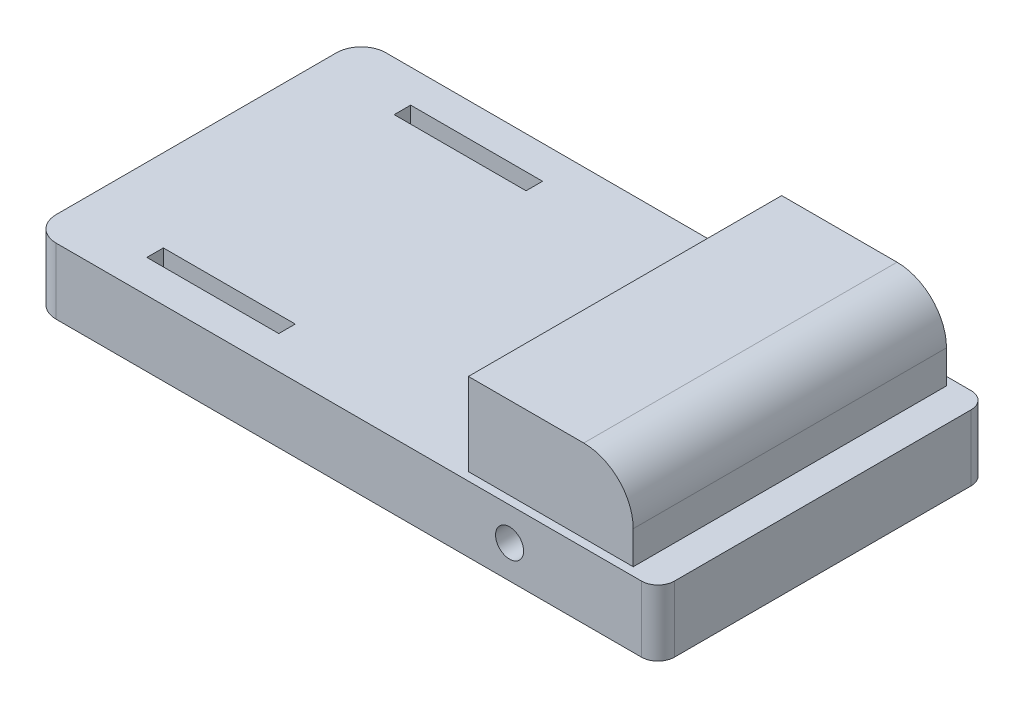
ISO-10303-21;
HEADER;
FILE_DESCRIPTION(('STEP AP214'),'2;1');
FILE_NAME('part.step','',(''),(''),'','','');
FILE_SCHEMA(('AUTOMOTIVE_DESIGN { 1 0 10303 214 1 1 1 1 }'));
ENDSEC;
DATA;
#1=APPLICATION_CONTEXT('core data for automotive mechanical design processes');
#2=APPLICATION_PROTOCOL_DEFINITION('international standard','automotive_design',2000,#1);
#3=PRODUCT_CONTEXT('',#1,'mechanical');
#4=PRODUCT('Part','Part','',(#3));
#5=PRODUCT_RELATED_PRODUCT_CATEGORY('part','',(#4));
#6=PRODUCT_DEFINITION_FORMATION('','',#4);
#7=PRODUCT_DEFINITION_CONTEXT('part definition',#1,'design');
#8=PRODUCT_DEFINITION('design','',#6,#7);
#9=PRODUCT_DEFINITION_SHAPE('','',#8);
#10=(LENGTH_UNIT() NAMED_UNIT(*) SI_UNIT(.MILLI.,.METRE.));
#11=(NAMED_UNIT(*) PLANE_ANGLE_UNIT() SI_UNIT($,.RADIAN.));
#12=(NAMED_UNIT(*) SI_UNIT($,.STERADIAN.) SOLID_ANGLE_UNIT());
#13=UNCERTAINTY_MEASURE_WITH_UNIT(LENGTH_MEASURE(1.E-05),#10,'distance_accuracy_value','');
#14=(GEOMETRIC_REPRESENTATION_CONTEXT(3) GLOBAL_UNCERTAINTY_ASSIGNED_CONTEXT((#13)) GLOBAL_UNIT_ASSIGNED_CONTEXT((#10,
#11,#12)) REPRESENTATION_CONTEXT('',''));
#15=CARTESIAN_POINT('',(0.,0.,0.));
#16=DIRECTION('',(0.,0.,1.));
#17=DIRECTION('',(1.,0.,0.));
#18=AXIS2_PLACEMENT_3D('',#15,#16,#17);
#19=CARTESIAN_POINT('',(0.,101.6,0.));
#20=DIRECTION('',(0.,1.,0.));
#21=DIRECTION('',(0.,0.,1.));
#22=AXIS2_PLACEMENT_3D('',#19,#20,#21);
#23=PLANE('',#22);
#24=DIRECTION('',(0.,0.,1.));
#25=VECTOR('',#24,1.);
#26=CARTESIAN_POINT('',(-355.6,101.6,177.8));
#27=LINE('',#26,#25);
#28=CARTESIAN_POINT('',(-355.6,101.6,177.8));
#29=VERTEX_POINT('',#28);
#30=CARTESIAN_POINT('',(-355.6,101.6,203.2));
#31=VERTEX_POINT('',#30);
#32=EDGE_CURVE('E277',#29,#31,#27,.T.);
#33=ORIENTED_EDGE('',*,*,#32,.F.);
#34=DIRECTION('',(-1.,0.,0.));
#35=VECTOR('',#34,1.);
#36=CARTESIAN_POINT('',(-355.6,101.6,177.8));
#37=LINE('',#36,#35);
#38=CARTESIAN_POINT('',(-152.4,101.6,177.8));
#39=VERTEX_POINT('',#38);
#40=EDGE_CURVE('E285',#39,#29,#37,.T.);
#41=ORIENTED_EDGE('',*,*,#40,.F.);
#42=DIRECTION('',(0.,0.,-1.));
#43=VECTOR('',#42,1.);
#44=CARTESIAN_POINT('',(-152.4,101.6,177.8));
#45=LINE('',#44,#43);
#46=CARTESIAN_POINT('',(-152.4,101.6,203.2));
#47=VERTEX_POINT('',#46);
#48=EDGE_CURVE('E282',#47,#39,#45,.T.);
#49=ORIENTED_EDGE('',*,*,#48,.F.);
#50=DIRECTION('',(1.,0.,0.));
#51=VECTOR('',#50,1.);
#52=CARTESIAN_POINT('',(-355.6,101.6,203.2));
#53=LINE('',#52,#51);
#54=EDGE_CURVE('E279',#31,#47,#53,.T.);
#55=ORIENTED_EDGE('',*,*,#54,.F.);
#56=EDGE_LOOP('',(#33,#41,#49,#55));
#57=FACE_BOUND('',#56,.T.);
#58=DIRECTION('',(1.,0.,0.));
#59=VECTOR('',#58,1.);
#60=CARTESIAN_POINT('',(-355.6,101.6,-177.8));
#61=LINE('',#60,#59);
#62=CARTESIAN_POINT('',(-355.6,101.6,-177.8));
#63=VERTEX_POINT('',#62);
#64=CARTESIAN_POINT('',(-152.4,101.6,-177.8));
#65=VERTEX_POINT('',#64);
#66=EDGE_CURVE('E308',#63,#65,#61,.T.);
#67=ORIENTED_EDGE('',*,*,#66,.F.);
#68=DIRECTION('',(0.,0.,1.));
#69=VECTOR('',#68,1.);
#70=CARTESIAN_POINT('',(-355.6,101.6,-177.8));
#71=LINE('',#70,#69);
#72=CARTESIAN_POINT('',(-355.6,101.6,-203.2));
#73=VERTEX_POINT('',#72);
#74=EDGE_CURVE('E316',#73,#63,#71,.T.);
#75=ORIENTED_EDGE('',*,*,#74,.F.);
#76=DIRECTION('',(-1.,0.,0.));
#77=VECTOR('',#76,1.);
#78=CARTESIAN_POINT('',(-355.6,101.6,-203.2));
#79=LINE('',#78,#77);
#80=CARTESIAN_POINT('',(-152.4,101.6,-203.2));
#81=VERTEX_POINT('',#80);
#82=EDGE_CURVE('E313',#81,#73,#79,.T.);
#83=ORIENTED_EDGE('',*,*,#82,.F.);
#84=DIRECTION('',(0.,0.,-1.));
#85=VECTOR('',#84,1.);
#86=CARTESIAN_POINT('',(-152.4,101.6,-177.8));
#87=LINE('',#86,#85);
#88=EDGE_CURVE('E310',#65,#81,#87,.T.);
#89=ORIENTED_EDGE('',*,*,#88,.F.);
#90=EDGE_LOOP('',(#67,#75,#83,#89));
#91=FACE_BOUND('',#90,.T.);
#92=DIRECTION('',(1.,0.,0.));
#93=VECTOR('',#92,1.);
#94=CARTESIAN_POINT('',(-482.6,101.6,254.));
#95=LINE('',#94,#93);
#96=CARTESIAN_POINT('',(-444.5,101.6,254.));
#97=VERTEX_POINT('',#96);
#98=CARTESIAN_POINT('',(457.2,101.6,254.));
#99=VERTEX_POINT('',#98);
#100=EDGE_CURVE('E339',#97,#99,#95,.T.);
#101=ORIENTED_EDGE('',*,*,#100,.T.);
#102=CARTESIAN_POINT('',(457.2,101.6,228.6));
#103=DIRECTION('',(0.,1.,0.));
#104=DIRECTION('',(0.,0.,1.));
#105=AXIS2_PLACEMENT_3D('',#102,#103,#104);
#106=CIRCLE('',#105,25.4);
#107=CARTESIAN_POINT('',(482.6,101.6,228.6));
#108=VERTEX_POINT('',#107);
#109=EDGE_CURVE('E390',#99,#108,#106,.T.);
#110=ORIENTED_EDGE('',*,*,#109,.T.);
#111=DIRECTION('',(0.,0.,-1.));
#112=VECTOR('',#111,1.);
#113=CARTESIAN_POINT('',(482.6,101.6,-254.));
#114=LINE('',#113,#112);
#115=CARTESIAN_POINT('',(482.6,101.6,-228.6));
#116=VERTEX_POINT('',#115);
#117=EDGE_CURVE('E343',#108,#116,#114,.T.);
#118=ORIENTED_EDGE('',*,*,#117,.T.);
#119=CARTESIAN_POINT('',(457.2,101.6,-228.6));
#120=DIRECTION('',(0.,1.,0.));
#121=DIRECTION('',(0.,0.,1.));
#122=AXIS2_PLACEMENT_3D('',#119,#120,#121);
#123=CIRCLE('',#122,25.4);
#124=CARTESIAN_POINT('',(457.2,101.6,-254.));
#125=VERTEX_POINT('',#124);
#126=EDGE_CURVE('E388',#116,#125,#123,.T.);
#127=ORIENTED_EDGE('',*,*,#126,.T.);
#128=DIRECTION('',(-1.,0.,0.));
#129=VECTOR('',#128,1.);
#130=CARTESIAN_POINT('',(-482.6,101.6,-254.));
#131=LINE('',#130,#129);
#132=CARTESIAN_POINT('',(-444.5,101.6,-254.));
#133=VERTEX_POINT('',#132);
#134=EDGE_CURVE('E346',#125,#133,#131,.T.);
#135=ORIENTED_EDGE('',*,*,#134,.T.);
#136=CARTESIAN_POINT('',(-444.5,101.6,-215.9));
#137=DIRECTION('',(0.,1.,0.));
#138=DIRECTION('',(0.,0.,1.));
#139=AXIS2_PLACEMENT_3D('',#136,#137,#138);
#140=CIRCLE('',#139,38.1);
#141=CARTESIAN_POINT('',(-482.6,101.6,-215.9));
#142=VERTEX_POINT('',#141);
#143=EDGE_CURVE('E372',#133,#142,#140,.T.);
#144=ORIENTED_EDGE('',*,*,#143,.T.);
#145=DIRECTION('',(0.,0.,1.));
#146=VECTOR('',#145,1.);
#147=CARTESIAN_POINT('',(-482.6,101.6,-254.));
#148=LINE('',#147,#146);
#149=CARTESIAN_POINT('',(-482.6,101.6,215.9));
#150=VERTEX_POINT('',#149);
#151=EDGE_CURVE('E336',#142,#150,#148,.T.);
#152=ORIENTED_EDGE('',*,*,#151,.T.);
#153=CARTESIAN_POINT('',(-444.5,101.6,215.9));
#154=DIRECTION('',(0.,1.,0.));
#155=DIRECTION('',(0.,0.,1.));
#156=AXIS2_PLACEMENT_3D('',#153,#154,#155);
#157=CIRCLE('',#156,38.1);
#158=EDGE_CURVE('E370',#150,#97,#157,.T.);
#159=ORIENTED_EDGE('',*,*,#158,.T.);
#160=EDGE_LOOP('',(#101,#110,#118,#127,#135,#144,#152,#159));
#161=FACE_BOUND('',#160,.T.);
#162=DIRECTION('',(1.,0.,0.));
#163=VECTOR('',#162,1.);
#164=CARTESIAN_POINT('',(177.882783197664,101.6,241.3));
#165=LINE('',#164,#163);
#166=CARTESIAN_POINT('',(177.882783197664,101.6,241.3));
#167=VERTEX_POINT('',#166);
#168=CARTESIAN_POINT('',(431.8,101.6,241.3));
#169=VERTEX_POINT('',#168);
#170=EDGE_CURVE('E251',#167,#169,#165,.T.);
#171=ORIENTED_EDGE('',*,*,#170,.F.);
#172=DIRECTION('',(0.,0.,1.));
#173=VECTOR('',#172,1.);
#174=CARTESIAN_POINT('',(177.882783197663,101.6,-241.3));
#175=LINE('',#174,#173);
#176=CARTESIAN_POINT('',(177.882783197664,101.6,228.6));
#177=VERTEX_POINT('',#176);
#178=EDGE_CURVE('E235',#177,#167,#175,.T.);
#179=ORIENTED_EDGE('',*,*,#178,.F.);
#180=DIRECTION('',(-1.,0.,0.));
#181=VECTOR('',#180,1.);
#182=CARTESIAN_POINT('',(356.882783197664,101.6,228.6));
#183=LINE('',#182,#181);
#184=CARTESIAN_POINT('',(356.882783197664,101.6,228.6));
#185=VERTEX_POINT('',#184);
#186=EDGE_CURVE('E208',#185,#177,#183,.T.);
#187=ORIENTED_EDGE('',*,*,#186,.F.);
#188=DIRECTION('',(0.,0.,1.));
#189=VECTOR('',#188,1.);
#190=CARTESIAN_POINT('',(356.882783197664,101.6,-228.6));
#191=LINE('',#190,#189);
#192=CARTESIAN_POINT('',(356.882783197664,101.6,-228.6));
#193=VERTEX_POINT('',#192);
#194=EDGE_CURVE('E212',#193,#185,#191,.T.);
#195=ORIENTED_EDGE('',*,*,#194,.F.);
#196=DIRECTION('',(-1.,0.,0.));
#197=VECTOR('',#196,1.);
#198=CARTESIAN_POINT('',(356.882783197664,101.6,-228.6));
#199=LINE('',#198,#197);
#200=CARTESIAN_POINT('',(177.882783197663,101.6,-228.6));
#201=VERTEX_POINT('',#200);
#202=EDGE_CURVE('E199',#193,#201,#199,.T.);
#203=ORIENTED_EDGE('',*,*,#202,.T.);
#204=CARTESIAN_POINT('',(177.882783197663,101.6,-241.3));
#205=VERTEX_POINT('',#204);
#206=EDGE_CURVE('E249',#205,#201,#175,.T.);
#207=ORIENTED_EDGE('',*,*,#206,.F.);
#208=DIRECTION('',(-1.,0.,0.));
#209=VECTOR('',#208,1.);
#210=CARTESIAN_POINT('',(177.882783197663,101.6,-241.3));
#211=LINE('',#210,#209);
#212=CARTESIAN_POINT('',(431.8,101.6,-241.3));
#213=VERTEX_POINT('',#212);
#214=EDGE_CURVE('E243',#213,#205,#211,.T.);
#215=ORIENTED_EDGE('',*,*,#214,.F.);
#216=DIRECTION('',(0.,0.,-1.));
#217=VECTOR('',#216,1.);
#218=CARTESIAN_POINT('',(431.8,101.6,-241.3));
#219=LINE('',#218,#217);
#220=EDGE_CURVE('E254',#169,#213,#219,.T.);
#221=ORIENTED_EDGE('',*,*,#220,.F.);
#222=EDGE_LOOP('',(#171,#179,#187,#195,#203,#207,#215,#221));
#223=FACE_BOUND('',#222,.T.);
#224=ADVANCED_FACE('F35',(#57,#91,#161,#223),#23,.T.);
#225=CARTESIAN_POINT('',(-482.6,101.6,-254.));
#226=DIRECTION('',(1.,0.,0.));
#227=DIRECTION('',(0.,0.,-1.));
#228=AXIS2_PLACEMENT_3D('',#225,#226,#227);
#229=PLANE('',#228);
#230=ORIENTED_EDGE('',*,*,#151,.F.);
#231=DIRECTION('',(0.,-1.,0.));
#232=VECTOR('',#231,1.);
#233=CARTESIAN_POINT('',(-482.6,101.6,-215.9));
#234=LINE('',#233,#232);
#235=CARTESIAN_POINT('',(-482.6,0.,-215.9));
#236=VERTEX_POINT('',#235);
#237=EDGE_CURVE('E359',#142,#236,#234,.T.);
#238=ORIENTED_EDGE('',*,*,#237,.T.);
#239=DIRECTION('',(0.,0.,1.));
#240=VECTOR('',#239,1.);
#241=CARTESIAN_POINT('',(-482.6,0.,-254.));
#242=LINE('',#241,#240);
#243=CARTESIAN_POINT('',(-482.6,0.,215.9));
#244=VERTEX_POINT('',#243);
#245=EDGE_CURVE('E333',#236,#244,#242,.T.);
#246=ORIENTED_EDGE('',*,*,#245,.T.);
#247=DIRECTION('',(0.,-1.,0.));
#248=VECTOR('',#247,1.);
#249=CARTESIAN_POINT('',(-482.6,101.6,215.9));
#250=LINE('',#249,#248);
#251=EDGE_CURVE('E348',#244,#150,#250,.F.);
#252=ORIENTED_EDGE('',*,*,#251,.T.);
#253=EDGE_LOOP('',(#230,#238,#246,#252));
#254=FACE_BOUND('',#253,.T.);
#255=ADVANCED_FACE('F433',(#254),#229,.F.);
#256=CARTESIAN_POINT('',(-482.6,101.6,254.));
#257=DIRECTION('',(0.,0.,-1.));
#258=DIRECTION('',(-1.,0.,0.));
#259=AXIS2_PLACEMENT_3D('',#256,#257,#258);
#260=PLANE('',#259);
#261=CARTESIAN_POINT('',(254.,50.8,254.));
#262=DIRECTION('',(0.,0.,1.));
#263=DIRECTION('',(1.,0.,0.));
#264=AXIS2_PLACEMENT_3D('',#261,#262,#263);
#265=CIRCLE('',#264,21.59);
#266=CARTESIAN_POINT('',(275.59,50.8,254.));
#267=VERTEX_POINT('',#266);
#268=EDGE_CURVE('E300',#267,#267,#265,.T.);
#269=ORIENTED_EDGE('',*,*,#268,.F.);
#270=EDGE_LOOP('',(#269));
#271=FACE_BOUND('',#270,.T.);
#272=DIRECTION('',(1.,0.,0.));
#273=VECTOR('',#272,1.);
#274=CARTESIAN_POINT('',(-482.6,0.,254.));
#275=LINE('',#274,#273);
#276=CARTESIAN_POINT('',(-444.5,0.,254.));
#277=VERTEX_POINT('',#276);
#278=CARTESIAN_POINT('',(457.2,0.,254.));
#279=VERTEX_POINT('',#278);
#280=EDGE_CURVE('E351',#277,#279,#275,.T.);
#281=ORIENTED_EDGE('',*,*,#280,.T.);
#282=DIRECTION('',(0.,-1.,0.));
#283=VECTOR('',#282,1.);
#284=CARTESIAN_POINT('',(457.2,101.6,254.));
#285=LINE('',#284,#283);
#286=EDGE_CURVE('E386',#279,#99,#285,.F.);
#287=ORIENTED_EDGE('',*,*,#286,.T.);
#288=ORIENTED_EDGE('',*,*,#100,.F.);
#289=DIRECTION('',(0.,-1.,0.));
#290=VECTOR('',#289,1.);
#291=CARTESIAN_POINT('',(-444.5,101.6,254.));
#292=LINE('',#291,#290);
#293=EDGE_CURVE('E374',#97,#277,#292,.T.);
#294=ORIENTED_EDGE('',*,*,#293,.T.);
#295=EDGE_LOOP('',(#281,#287,#288,#294));
#296=FACE_BOUND('',#295,.T.);
#297=ADVANCED_FACE('F439',(#271,#296),#260,.F.);
#298=CARTESIAN_POINT('',(482.6,101.6,-254.));
#299=DIRECTION('',(-1.,0.,0.));
#300=DIRECTION('',(0.,0.,1.));
#301=AXIS2_PLACEMENT_3D('',#298,#299,#300);
#302=PLANE('',#301);
#303=ORIENTED_EDGE('',*,*,#117,.F.);
#304=DIRECTION('',(0.,-1.,0.));
#305=VECTOR('',#304,1.);
#306=CARTESIAN_POINT('',(482.6,101.6,228.6));
#307=LINE('',#306,#305);
#308=CARTESIAN_POINT('',(482.6,0.,228.6));
#309=VERTEX_POINT('',#308);
#310=EDGE_CURVE('E379',#108,#309,#307,.T.);
#311=ORIENTED_EDGE('',*,*,#310,.T.);
#312=DIRECTION('',(0.,0.,-1.));
#313=VECTOR('',#312,1.);
#314=CARTESIAN_POINT('',(482.6,0.,-254.));
#315=LINE('',#314,#313);
#316=CARTESIAN_POINT('',(482.6,0.,-228.6));
#317=VERTEX_POINT('',#316);
#318=EDGE_CURVE('E354',#309,#317,#315,.T.);
#319=ORIENTED_EDGE('',*,*,#318,.T.);
#320=DIRECTION('',(0.,-1.,0.));
#321=VECTOR('',#320,1.);
#322=CARTESIAN_POINT('',(482.6,101.6,-228.6));
#323=LINE('',#322,#321);
#324=EDGE_CURVE('E377',#317,#116,#323,.F.);
#325=ORIENTED_EDGE('',*,*,#324,.T.);
#326=EDGE_LOOP('',(#303,#311,#319,#325));
#327=FACE_BOUND('',#326,.T.);
#328=ADVANCED_FACE('F455',(#327),#302,.F.);
#329=CARTESIAN_POINT('',(-482.6,101.6,-254.));
#330=DIRECTION('',(0.,0.,1.));
#331=DIRECTION('',(1.,0.,0.));
#332=AXIS2_PLACEMENT_3D('',#329,#330,#331);
#333=PLANE('',#332);
#334=CARTESIAN_POINT('',(254.,50.8,-254.));
#335=DIRECTION('',(0.,0.,1.));
#336=DIRECTION('',(1.,0.,0.));
#337=AXIS2_PLACEMENT_3D('',#334,#335,#336);
#338=CIRCLE('',#337,21.59);
#339=CARTESIAN_POINT('',(275.59,50.8,-254.));
#340=VERTEX_POINT('',#339);
#341=EDGE_CURVE('E330',#340,#340,#338,.T.);
#342=ORIENTED_EDGE('',*,*,#341,.T.);
#343=EDGE_LOOP('',(#342));
#344=FACE_BOUND('',#343,.T.);
#345=ORIENTED_EDGE('',*,*,#134,.F.);
#346=DIRECTION('',(0.,-1.,0.));
#347=VECTOR('',#346,1.);
#348=CARTESIAN_POINT('',(457.2,101.6,-254.));
#349=LINE('',#348,#347);
#350=CARTESIAN_POINT('',(457.2,0.,-254.));
#351=VERTEX_POINT('',#350);
#352=EDGE_CURVE('E392',#125,#351,#349,.T.);
#353=ORIENTED_EDGE('',*,*,#352,.T.);
#354=DIRECTION('',(-1.,0.,0.));
#355=VECTOR('',#354,1.);
#356=CARTESIAN_POINT('',(-482.6,0.,-254.));
#357=LINE('',#356,#355);
#358=CARTESIAN_POINT('',(-444.5,0.,-254.));
#359=VERTEX_POINT('',#358);
#360=EDGE_CURVE('E340',#351,#359,#357,.T.);
#361=ORIENTED_EDGE('',*,*,#360,.T.);
#362=DIRECTION('',(0.,-1.,0.));
#363=VECTOR('',#362,1.);
#364=CARTESIAN_POINT('',(-444.5,101.6,-254.));
#365=LINE('',#364,#363);
#366=EDGE_CURVE('E367',#359,#133,#365,.F.);
#367=ORIENTED_EDGE('',*,*,#366,.T.);
#368=EDGE_LOOP('',(#345,#353,#361,#367));
#369=FACE_BOUND('',#368,.T.);
#370=ADVANCED_FACE('F451',(#344,#369),#333,.F.);
#371=CARTESIAN_POINT('',(0.,0.,0.));
#372=DIRECTION('',(0.,1.,0.));
#373=DIRECTION('',(0.,0.,1.));
#374=AXIS2_PLACEMENT_3D('',#371,#372,#373);
#375=PLANE('',#374);
#376=DIRECTION('',(1.,0.,0.));
#377=VECTOR('',#376,1.);
#378=CARTESIAN_POINT('',(-355.6,0.,177.8));
#379=LINE('',#378,#377);
#380=CARTESIAN_POINT('',(-355.6,0.,177.8));
#381=VERTEX_POINT('',#380);
#382=CARTESIAN_POINT('',(-152.4,0.,177.8));
#383=VERTEX_POINT('',#382);
#384=EDGE_CURVE('E270',#381,#383,#379,.T.);
#385=ORIENTED_EDGE('',*,*,#384,.F.);
#386=DIRECTION('',(0.,0.,-1.));
#387=VECTOR('',#386,1.);
#388=CARTESIAN_POINT('',(-355.6,0.,177.8));
#389=LINE('',#388,#387);
#390=CARTESIAN_POINT('',(-355.6,0.,203.2));
#391=VERTEX_POINT('',#390);
#392=EDGE_CURVE('E274',#391,#381,#389,.T.);
#393=ORIENTED_EDGE('',*,*,#392,.F.);
#394=DIRECTION('',(-1.,0.,0.));
#395=VECTOR('',#394,1.);
#396=CARTESIAN_POINT('',(-355.6,0.,203.2));
#397=LINE('',#396,#395);
#398=CARTESIAN_POINT('',(-152.4,0.,203.2));
#399=VERTEX_POINT('',#398);
#400=EDGE_CURVE('E291',#399,#391,#397,.T.);
#401=ORIENTED_EDGE('',*,*,#400,.F.);
#402=DIRECTION('',(0.,0.,1.));
#403=VECTOR('',#402,1.);
#404=CARTESIAN_POINT('',(-152.4,0.,177.8));
#405=LINE('',#404,#403);
#406=EDGE_CURVE('E268',#383,#399,#405,.T.);
#407=ORIENTED_EDGE('',*,*,#406,.F.);
#408=EDGE_LOOP('',(#385,#393,#401,#407));
#409=FACE_BOUND('',#408,.T.);
#410=DIRECTION('',(0.,0.,-1.));
#411=VECTOR('',#410,1.);
#412=CARTESIAN_POINT('',(-355.6,0.,-177.8));
#413=LINE('',#412,#411);
#414=CARTESIAN_POINT('',(-355.6,0.,-177.8));
#415=VERTEX_POINT('',#414);
#416=CARTESIAN_POINT('',(-355.6,0.,-203.2));
#417=VERTEX_POINT('',#416);
#418=EDGE_CURVE('E302',#415,#417,#413,.T.);
#419=ORIENTED_EDGE('',*,*,#418,.F.);
#420=DIRECTION('',(-1.,0.,0.));
#421=VECTOR('',#420,1.);
#422=CARTESIAN_POINT('',(-355.6,0.,-177.8));
#423=LINE('',#422,#421);
#424=CARTESIAN_POINT('',(-152.4,0.,-177.8));
#425=VERTEX_POINT('',#424);
#426=EDGE_CURVE('E305',#425,#415,#423,.T.);
#427=ORIENTED_EDGE('',*,*,#426,.F.);
#428=DIRECTION('',(0.,0.,1.));
#429=VECTOR('',#428,1.);
#430=CARTESIAN_POINT('',(-152.4,0.,-177.8));
#431=LINE('',#430,#429);
#432=CARTESIAN_POINT('',(-152.4,0.,-203.2));
#433=VERTEX_POINT('',#432);
#434=EDGE_CURVE('E271',#433,#425,#431,.T.);
#435=ORIENTED_EDGE('',*,*,#434,.F.);
#436=DIRECTION('',(1.,0.,0.));
#437=VECTOR('',#436,1.);
#438=CARTESIAN_POINT('',(-355.6,0.,-203.2));
#439=LINE('',#438,#437);
#440=EDGE_CURVE('E267',#417,#433,#439,.T.);
#441=ORIENTED_EDGE('',*,*,#440,.F.);
#442=EDGE_LOOP('',(#419,#427,#435,#441));
#443=FACE_BOUND('',#442,.T.);
#444=ORIENTED_EDGE('',*,*,#318,.F.);
#445=CARTESIAN_POINT('',(457.2,0.,228.6));
#446=DIRECTION('',(0.,1.,0.));
#447=DIRECTION('',(0.,0.,1.));
#448=AXIS2_PLACEMENT_3D('',#445,#446,#447);
#449=CIRCLE('',#448,25.4);
#450=EDGE_CURVE('E384',#309,#279,#449,.F.);
#451=ORIENTED_EDGE('',*,*,#450,.T.);
#452=ORIENTED_EDGE('',*,*,#280,.F.);
#453=CARTESIAN_POINT('',(-444.5,0.,215.9));
#454=DIRECTION('',(0.,1.,0.));
#455=DIRECTION('',(0.,0.,1.));
#456=AXIS2_PLACEMENT_3D('',#453,#454,#455);
#457=CIRCLE('',#456,38.1);
#458=EDGE_CURVE('E362',#277,#244,#457,.F.);
#459=ORIENTED_EDGE('',*,*,#458,.T.);
#460=ORIENTED_EDGE('',*,*,#245,.F.);
#461=CARTESIAN_POINT('',(-444.5,0.,-215.9));
#462=DIRECTION('',(0.,1.,0.));
#463=DIRECTION('',(0.,0.,1.));
#464=AXIS2_PLACEMENT_3D('',#461,#462,#463);
#465=CIRCLE('',#464,38.1);
#466=EDGE_CURVE('E364',#236,#359,#465,.F.);
#467=ORIENTED_EDGE('',*,*,#466,.T.);
#468=ORIENTED_EDGE('',*,*,#360,.F.);
#469=CARTESIAN_POINT('',(457.2,0.,-228.6));
#470=DIRECTION('',(0.,1.,0.));
#471=DIRECTION('',(0.,0.,1.));
#472=AXIS2_PLACEMENT_3D('',#469,#470,#471);
#473=CIRCLE('',#472,25.4);
#474=EDGE_CURVE('E382',#351,#317,#473,.F.);
#475=ORIENTED_EDGE('',*,*,#474,.T.);
#476=EDGE_LOOP('',(#444,#451,#452,#459,#460,#467,#468,#475));
#477=FACE_BOUND('',#476,.T.);
#478=ADVANCED_FACE('F448',(#409,#443,#477),#375,.F.);
#479=CARTESIAN_POINT('',(254.,50.8,-254.));
#480=DIRECTION('',(0.,0.,1.));
#481=DIRECTION('',(1.,0.,0.));
#482=AXIS2_PLACEMENT_3D('',#479,#480,#481);
#483=CYLINDRICAL_SURFACE('',#482,21.59);
#484=ORIENTED_EDGE('',*,*,#341,.F.);
#485=EDGE_LOOP('',(#484));
#486=FACE_BOUND('',#485,.T.);
#487=ORIENTED_EDGE('',*,*,#268,.T.);
#488=EDGE_LOOP('',(#487));
#489=FACE_BOUND('',#488,.T.);
#490=ADVANCED_FACE('F446',(#486,#489),#483,.F.);
#491=CARTESIAN_POINT('',(-444.5,101.6,-215.9));
#492=DIRECTION('',(0.,-1.,0.));
#493=DIRECTION('',(0.,0.,-1.));
#494=AXIS2_PLACEMENT_3D('',#491,#492,#493);
#495=CYLINDRICAL_SURFACE('',#494,38.1);
#496=ORIENTED_EDGE('',*,*,#143,.F.);
#497=ORIENTED_EDGE('',*,*,#366,.F.);
#498=ORIENTED_EDGE('',*,*,#466,.F.);
#499=ORIENTED_EDGE('',*,*,#237,.F.);
#500=EDGE_LOOP('',(#496,#497,#498,#499));
#501=FACE_BOUND('',#500,.T.);
#502=ADVANCED_FACE('F463',(#501),#495,.T.);
#503=CARTESIAN_POINT('',(-444.5,101.6,215.9));
#504=DIRECTION('',(0.,-1.,0.));
#505=DIRECTION('',(0.,0.,-1.));
#506=AXIS2_PLACEMENT_3D('',#503,#504,#505);
#507=CYLINDRICAL_SURFACE('',#506,38.1);
#508=ORIENTED_EDGE('',*,*,#158,.F.);
#509=ORIENTED_EDGE('',*,*,#251,.F.);
#510=ORIENTED_EDGE('',*,*,#458,.F.);
#511=ORIENTED_EDGE('',*,*,#293,.F.);
#512=EDGE_LOOP('',(#508,#509,#510,#511));
#513=FACE_BOUND('',#512,.T.);
#514=ADVANCED_FACE('F466',(#513),#507,.T.);
#515=CARTESIAN_POINT('',(457.2,101.6,228.6));
#516=DIRECTION('',(0.,-1.,0.));
#517=DIRECTION('',(0.,0.,-1.));
#518=AXIS2_PLACEMENT_3D('',#515,#516,#517);
#519=CYLINDRICAL_SURFACE('',#518,25.4);
#520=ORIENTED_EDGE('',*,*,#109,.F.);
#521=ORIENTED_EDGE('',*,*,#286,.F.);
#522=ORIENTED_EDGE('',*,*,#450,.F.);
#523=ORIENTED_EDGE('',*,*,#310,.F.);
#524=EDGE_LOOP('',(#520,#521,#522,#523));
#525=FACE_BOUND('',#524,.T.);
#526=ADVANCED_FACE('F470',(#525),#519,.T.);
#527=CARTESIAN_POINT('',(457.2,101.6,-228.6));
#528=DIRECTION('',(0.,-1.,0.));
#529=DIRECTION('',(0.,0.,-1.));
#530=AXIS2_PLACEMENT_3D('',#527,#528,#529);
#531=CYLINDRICAL_SURFACE('',#530,25.4);
#532=ORIENTED_EDGE('',*,*,#126,.F.);
#533=ORIENTED_EDGE('',*,*,#324,.F.);
#534=ORIENTED_EDGE('',*,*,#474,.F.);
#535=ORIENTED_EDGE('',*,*,#352,.F.);
#536=EDGE_LOOP('',(#532,#533,#534,#535));
#537=FACE_BOUND('',#536,.T.);
#538=ADVANCED_FACE('F473',(#537),#531,.T.);
#539=CARTESIAN_POINT('',(-355.6,-0.001000000000001,-177.8));
#540=DIRECTION('',(0.,0.,1.));
#541=DIRECTION('',(1.,0.,0.));
#542=AXIS2_PLACEMENT_3D('',#539,#540,#541);
#543=PLANE('',#542);
#544=ORIENTED_EDGE('',*,*,#426,.T.);
#545=DIRECTION('',(0.,1.,0.));
#546=VECTOR('',#545,1.);
#547=CARTESIAN_POINT('',(-355.6,-0.001000000000001,-177.8));
#548=LINE('',#547,#546);
#549=EDGE_CURVE('E320',#415,#63,#548,.T.);
#550=ORIENTED_EDGE('',*,*,#549,.T.);
#551=ORIENTED_EDGE('',*,*,#66,.T.);
#552=DIRECTION('',(0.,1.,0.));
#553=VECTOR('',#552,1.);
#554=CARTESIAN_POINT('',(-152.4,-0.001000000000001,-177.8));
#555=LINE('',#554,#553);
#556=EDGE_CURVE('E319',#425,#65,#555,.T.);
#557=ORIENTED_EDGE('',*,*,#556,.F.);
#558=EDGE_LOOP('',(#544,#550,#551,#557));
#559=FACE_BOUND('',#558,.T.);
#560=ADVANCED_FACE('F476',(#559),#543,.F.);
#561=CARTESIAN_POINT('',(-355.6,-0.001000000000001,-177.8));
#562=DIRECTION('',(-1.,0.,0.));
#563=DIRECTION('',(0.,0.,1.));
#564=AXIS2_PLACEMENT_3D('',#561,#562,#563);
#565=PLANE('',#564);
#566=ORIENTED_EDGE('',*,*,#418,.T.);
#567=DIRECTION('',(0.,1.,0.));
#568=VECTOR('',#567,1.);
#569=CARTESIAN_POINT('',(-355.6,-0.001000000000001,-203.2));
#570=LINE('',#569,#568);
#571=EDGE_CURVE('E322',#417,#73,#570,.T.);
#572=ORIENTED_EDGE('',*,*,#571,.T.);
#573=ORIENTED_EDGE('',*,*,#74,.T.);
#574=ORIENTED_EDGE('',*,*,#549,.F.);
#575=EDGE_LOOP('',(#566,#572,#573,#574));
#576=FACE_BOUND('',#575,.T.);
#577=ADVANCED_FACE('F481',(#576),#565,.F.);
#578=CARTESIAN_POINT('',(-355.6,-0.001000000000001,-203.2));
#579=DIRECTION('',(0.,0.,-1.));
#580=DIRECTION('',(-1.,0.,0.));
#581=AXIS2_PLACEMENT_3D('',#578,#579,#580);
#582=PLANE('',#581);
#583=ORIENTED_EDGE('',*,*,#440,.T.);
#584=DIRECTION('',(0.,1.,0.));
#585=VECTOR('',#584,1.);
#586=CARTESIAN_POINT('',(-152.4,-0.001000000000001,-203.2));
#587=LINE('',#586,#585);
#588=EDGE_CURVE('E324',#433,#81,#587,.T.);
#589=ORIENTED_EDGE('',*,*,#588,.T.);
#590=ORIENTED_EDGE('',*,*,#82,.T.);
#591=ORIENTED_EDGE('',*,*,#571,.F.);
#592=EDGE_LOOP('',(#583,#589,#590,#591));
#593=FACE_BOUND('',#592,.T.);
#594=ADVANCED_FACE('F510',(#593),#582,.F.);
#595=CARTESIAN_POINT('',(-152.4,-0.001000000000001,-177.8));
#596=DIRECTION('',(1.,0.,0.));
#597=DIRECTION('',(0.,0.,-1.));
#598=AXIS2_PLACEMENT_3D('',#595,#596,#597);
#599=PLANE('',#598);
#600=ORIENTED_EDGE('',*,*,#434,.T.);
#601=ORIENTED_EDGE('',*,*,#556,.T.);
#602=ORIENTED_EDGE('',*,*,#88,.T.);
#603=ORIENTED_EDGE('',*,*,#588,.F.);
#604=EDGE_LOOP('',(#600,#601,#602,#603));
#605=FACE_BOUND('',#604,.T.);
#606=ADVANCED_FACE('F514',(#605),#599,.F.);
#607=CARTESIAN_POINT('',(-355.6,-0.001000000000001,177.8));
#608=DIRECTION('',(-1.,0.,0.));
#609=DIRECTION('',(0.,0.,1.));
#610=AXIS2_PLACEMENT_3D('',#607,#608,#609);
#611=PLANE('',#610);
#612=ORIENTED_EDGE('',*,*,#392,.T.);
#613=DIRECTION('',(0.,1.,0.));
#614=VECTOR('',#613,1.);
#615=CARTESIAN_POINT('',(-355.6,-0.001000000000001,177.8));
#616=LINE('',#615,#614);
#617=EDGE_CURVE('E289',#381,#29,#616,.T.);
#618=ORIENTED_EDGE('',*,*,#617,.T.);
#619=ORIENTED_EDGE('',*,*,#32,.T.);
#620=DIRECTION('',(0.,1.,0.));
#621=VECTOR('',#620,1.);
#622=CARTESIAN_POINT('',(-355.6,-0.001000000000001,203.2));
#623=LINE('',#622,#621);
#624=EDGE_CURVE('E288',#391,#31,#623,.T.);
#625=ORIENTED_EDGE('',*,*,#624,.F.);
#626=EDGE_LOOP('',(#612,#618,#619,#625));
#627=FACE_BOUND('',#626,.T.);
#628=ADVANCED_FACE('F517',(#627),#611,.F.);
#629=CARTESIAN_POINT('',(-355.6,-0.001000000000001,177.8));
#630=DIRECTION('',(0.,0.,-1.));
#631=DIRECTION('',(-1.,0.,0.));
#632=AXIS2_PLACEMENT_3D('',#629,#630,#631);
#633=PLANE('',#632);
#634=ORIENTED_EDGE('',*,*,#384,.T.);
#635=DIRECTION('',(0.,1.,0.));
#636=VECTOR('',#635,1.);
#637=CARTESIAN_POINT('',(-152.4,-0.001000000000001,177.8));
#638=LINE('',#637,#636);
#639=EDGE_CURVE('E292',#383,#39,#638,.T.);
#640=ORIENTED_EDGE('',*,*,#639,.T.);
#641=ORIENTED_EDGE('',*,*,#40,.T.);
#642=ORIENTED_EDGE('',*,*,#617,.F.);
#643=EDGE_LOOP('',(#634,#640,#641,#642));
#644=FACE_BOUND('',#643,.T.);
#645=ADVANCED_FACE('F524',(#644),#633,.F.);
#646=CARTESIAN_POINT('',(-152.4,-0.001000000000001,177.8));
#647=DIRECTION('',(1.,0.,0.));
#648=DIRECTION('',(0.,0.,-1.));
#649=AXIS2_PLACEMENT_3D('',#646,#647,#648);
#650=PLANE('',#649);
#651=ORIENTED_EDGE('',*,*,#406,.T.);
#652=DIRECTION('',(0.,1.,0.));
#653=VECTOR('',#652,1.);
#654=CARTESIAN_POINT('',(-152.4,-0.001000000000001,203.2));
#655=LINE('',#654,#653);
#656=EDGE_CURVE('E294',#399,#47,#655,.T.);
#657=ORIENTED_EDGE('',*,*,#656,.T.);
#658=ORIENTED_EDGE('',*,*,#48,.T.);
#659=ORIENTED_EDGE('',*,*,#639,.F.);
#660=EDGE_LOOP('',(#651,#657,#658,#659));
#661=FACE_BOUND('',#660,.T.);
#662=ADVANCED_FACE('F529',(#661),#650,.F.);
#663=CARTESIAN_POINT('',(-355.6,-0.001000000000001,203.2));
#664=DIRECTION('',(0.,0.,1.));
#665=DIRECTION('',(1.,0.,0.));
#666=AXIS2_PLACEMENT_3D('',#663,#664,#665);
#667=PLANE('',#666);
#668=ORIENTED_EDGE('',*,*,#400,.T.);
#669=ORIENTED_EDGE('',*,*,#624,.T.);
#670=ORIENTED_EDGE('',*,*,#54,.T.);
#671=ORIENTED_EDGE('',*,*,#656,.F.);
#672=EDGE_LOOP('',(#668,#669,#670,#671));
#673=FACE_BOUND('',#672,.T.);
#674=ADVANCED_FACE('F526',(#673),#667,.F.);
#675=CARTESIAN_POINT('',(177.882783197663,228.6,-241.3));
#676=DIRECTION('',(1.,0.,0.));
#677=DIRECTION('',(0.,0.,-1.));
#678=AXIS2_PLACEMENT_3D('',#675,#676,#677);
#679=PLANE('',#678);
#680=ORIENTED_EDGE('',*,*,#206,.T.);
#681=DIRECTION('',(0.,-1.,0.));
#682=VECTOR('',#681,1.);
#683=CARTESIAN_POINT('',(177.882783197663,215.9,-228.6));
#684=LINE('',#683,#682);
#685=CARTESIAN_POINT('',(177.882783197663,215.9,-228.6));
#686=VERTEX_POINT('',#685);
#687=EDGE_CURVE('E50',#686,#201,#684,.T.);
#688=ORIENTED_EDGE('',*,*,#687,.F.);
#689=DIRECTION('',(0.,0.,-1.));
#690=VECTOR('',#689,1.);
#691=CARTESIAN_POINT('',(177.882783197663,215.9,-228.6));
#692=LINE('',#691,#690);
#693=CARTESIAN_POINT('',(177.882783197664,215.9,228.6));
#694=VERTEX_POINT('',#693);
#695=EDGE_CURVE('E222',#694,#686,#692,.T.);
#696=ORIENTED_EDGE('',*,*,#695,.F.);
#697=DIRECTION('',(0.,1.,0.));
#698=VECTOR('',#697,1.);
#699=CARTESIAN_POINT('',(177.882783197664,215.9,228.6));
#700=LINE('',#699,#698);
#701=EDGE_CURVE('E225',#177,#694,#700,.T.);
#702=ORIENTED_EDGE('',*,*,#701,.F.);
#703=ORIENTED_EDGE('',*,*,#178,.T.);
#704=DIRECTION('',(0.,-1.,0.));
#705=VECTOR('',#704,1.);
#706=CARTESIAN_POINT('',(177.882783197664,228.6,241.3));
#707=LINE('',#706,#705);
#708=CARTESIAN_POINT('',(177.882783197664,228.6,241.3));
#709=VERTEX_POINT('',#708);
#710=EDGE_CURVE('E264',#709,#167,#707,.T.);
#711=ORIENTED_EDGE('',*,*,#710,.F.);
#712=DIRECTION('',(0.,0.,1.));
#713=VECTOR('',#712,1.);
#714=CARTESIAN_POINT('',(177.882783197663,228.6,-241.3));
#715=LINE('',#714,#713);
#716=CARTESIAN_POINT('',(177.882783197663,228.6,-241.3));
#717=VERTEX_POINT('',#716);
#718=EDGE_CURVE('E239',#717,#709,#715,.T.);
#719=ORIENTED_EDGE('',*,*,#718,.F.);
#720=DIRECTION('',(0.,-1.,0.));
#721=VECTOR('',#720,1.);
#722=CARTESIAN_POINT('',(177.882783197663,228.6,-241.3));
#723=LINE('',#722,#721);
#724=EDGE_CURVE('E248',#717,#205,#723,.T.);
#725=ORIENTED_EDGE('',*,*,#724,.T.);
#726=EDGE_LOOP('',(#680,#688,#696,#702,#703,#711,#719,#725));
#727=FACE_BOUND('',#726,.T.);
#728=ADVANCED_FACE('F416',(#727),#679,.F.);
#729=CARTESIAN_POINT('',(177.882783197664,228.6,241.3));
#730=DIRECTION('',(0.,0.,-1.));
#731=DIRECTION('',(-1.,0.,0.));
#732=AXIS2_PLACEMENT_3D('',#729,#730,#731);
#733=PLANE('',#732);
#734=DIRECTION('',(0.,-1.,0.));
#735=VECTOR('',#734,1.);
#736=CARTESIAN_POINT('',(431.8,228.6,241.3));
#737=LINE('',#736,#735);
#738=CARTESIAN_POINT('',(431.8,152.4,241.3));
#739=VERTEX_POINT('',#738);
#740=EDGE_CURVE('E262',#739,#169,#737,.T.);
#741=ORIENTED_EDGE('',*,*,#740,.F.);
#742=CARTESIAN_POINT('',(355.6,152.4,241.3));
#743=DIRECTION('',(0.,0.,-1.));
#744=DIRECTION('',(-1.,0.,0.));
#745=AXIS2_PLACEMENT_3D('',#742,#743,#744);
#746=CIRCLE('',#745,76.2);
#747=CARTESIAN_POINT('',(355.6,228.6,241.3));
#748=VERTEX_POINT('',#747);
#749=EDGE_CURVE('E11',#739,#748,#746,.F.);
#750=ORIENTED_EDGE('',*,*,#749,.T.);
#751=DIRECTION('',(1.,0.,0.));
#752=VECTOR('',#751,1.);
#753=CARTESIAN_POINT('',(177.882783197664,228.6,241.3));
#754=LINE('',#753,#752);
#755=EDGE_CURVE('E242',#709,#748,#754,.T.);
#756=ORIENTED_EDGE('',*,*,#755,.F.);
#757=ORIENTED_EDGE('',*,*,#710,.T.);
#758=ORIENTED_EDGE('',*,*,#170,.T.);
#759=EDGE_LOOP('',(#741,#750,#756,#757,#758));
#760=FACE_BOUND('',#759,.T.);
#761=ADVANCED_FACE('F410',(#760),#733,.F.);
#762=CARTESIAN_POINT('',(431.8,228.6,-241.3));
#763=DIRECTION('',(-1.,0.,0.));
#764=DIRECTION('',(0.,0.,1.));
#765=AXIS2_PLACEMENT_3D('',#762,#763,#764);
#766=PLANE('',#765);
#767=DIRECTION('',(0.,-1.,0.));
#768=VECTOR('',#767,1.);
#769=CARTESIAN_POINT('',(431.8,228.6,-241.3));
#770=LINE('',#769,#768);
#771=CARTESIAN_POINT('',(431.8,152.4,-241.3));
#772=VERTEX_POINT('',#771);
#773=EDGE_CURVE('E260',#772,#213,#770,.T.);
#774=ORIENTED_EDGE('',*,*,#773,.F.);
#775=DIRECTION('',(0.,0.,-1.));
#776=VECTOR('',#775,1.);
#777=CARTESIAN_POINT('',(431.8,152.4,241.3));
#778=LINE('',#777,#776);
#779=EDGE_CURVE('E43',#772,#739,#778,.F.);
#780=ORIENTED_EDGE('',*,*,#779,.T.);
#781=ORIENTED_EDGE('',*,*,#740,.T.);
#782=ORIENTED_EDGE('',*,*,#220,.T.);
#783=EDGE_LOOP('',(#774,#780,#781,#782));
#784=FACE_BOUND('',#783,.T.);
#785=ADVANCED_FACE('F405',(#784),#766,.F.);
#786=CARTESIAN_POINT('',(177.882783197663,228.6,-241.3));
#787=DIRECTION('',(0.,0.,1.));
#788=DIRECTION('',(1.,0.,0.));
#789=AXIS2_PLACEMENT_3D('',#786,#787,#788);
#790=PLANE('',#789);
#791=DIRECTION('',(-1.,0.,0.));
#792=VECTOR('',#791,1.);
#793=CARTESIAN_POINT('',(177.882783197663,228.6,-241.3));
#794=LINE('',#793,#792);
#795=CARTESIAN_POINT('',(355.6,228.6,-241.3));
#796=VERTEX_POINT('',#795);
#797=EDGE_CURVE('E246',#796,#717,#794,.T.);
#798=ORIENTED_EDGE('',*,*,#797,.F.);
#799=CARTESIAN_POINT('',(355.6,152.4,-241.3));
#800=DIRECTION('',(0.,0.,1.));
#801=DIRECTION('',(1.,0.,0.));
#802=AXIS2_PLACEMENT_3D('',#799,#800,#801);
#803=CIRCLE('',#802,76.2);
#804=EDGE_CURVE('E398',#796,#772,#803,.F.);
#805=ORIENTED_EDGE('',*,*,#804,.T.);
#806=ORIENTED_EDGE('',*,*,#773,.T.);
#807=ORIENTED_EDGE('',*,*,#214,.T.);
#808=ORIENTED_EDGE('',*,*,#724,.F.);
#809=EDGE_LOOP('',(#798,#805,#806,#807,#808));
#810=FACE_BOUND('',#809,.T.);
#811=ADVANCED_FACE('F401',(#810),#790,.F.);
#812=CARTESIAN_POINT('',(0.,228.6,0.));
#813=DIRECTION('',(0.,1.,0.));
#814=DIRECTION('',(0.,0.,1.));
#815=AXIS2_PLACEMENT_3D('',#812,#813,#814);
#816=PLANE('',#815);
#817=ORIENTED_EDGE('',*,*,#755,.T.);
#818=DIRECTION('',(0.,0.,-1.));
#819=VECTOR('',#818,1.);
#820=CARTESIAN_POINT('',(355.6,228.6,-241.3));
#821=LINE('',#820,#819);
#822=EDGE_CURVE('E395',#748,#796,#821,.T.);
#823=ORIENTED_EDGE('',*,*,#822,.T.);
#824=ORIENTED_EDGE('',*,*,#797,.T.);
#825=ORIENTED_EDGE('',*,*,#718,.T.);
#826=EDGE_LOOP('',(#817,#823,#824,#825));
#827=FACE_BOUND('',#826,.T.);
#828=ADVANCED_FACE('F412',(#827),#816,.T.);
#829=CARTESIAN_POINT('',(355.6,152.4,0.));
#830=DIRECTION('',(0.,0.,1.));
#831=DIRECTION('',(1.,0.,0.));
#832=AXIS2_PLACEMENT_3D('',#829,#830,#831);
#833=CYLINDRICAL_SURFACE('',#832,76.2);
#834=ORIENTED_EDGE('',*,*,#749,.F.);
#835=ORIENTED_EDGE('',*,*,#779,.F.);
#836=ORIENTED_EDGE('',*,*,#804,.F.);
#837=ORIENTED_EDGE('',*,*,#822,.F.);
#838=EDGE_LOOP('',(#834,#835,#836,#837));
#839=FACE_BOUND('',#838,.T.);
#840=ADVANCED_FACE('F37',(#839),#833,.T.);
#841=CARTESIAN_POINT('',(356.882783197664,215.9,-228.6));
#842=DIRECTION('',(0.,0.,-1.));
#843=DIRECTION('',(0.,1.,0.));
#844=AXIS2_PLACEMENT_3D('',#841,#842,#843);
#845=PLANE('',#844);
#846=ORIENTED_EDGE('',*,*,#687,.T.);
#847=ORIENTED_EDGE('',*,*,#202,.F.);
#848=DIRECTION('',(0.,-1.,0.));
#849=VECTOR('',#848,1.);
#850=CARTESIAN_POINT('',(356.882783197664,215.9,-228.6));
#851=LINE('',#850,#849);
#852=CARTESIAN_POINT('',(356.882783197664,215.9,-228.6));
#853=VERTEX_POINT('',#852);
#854=EDGE_CURVE('E203',#853,#193,#851,.T.);
#855=ORIENTED_EDGE('',*,*,#854,.F.);
#856=DIRECTION('',(-1.,0.,0.));
#857=VECTOR('',#856,1.);
#858=CARTESIAN_POINT('',(356.882783197664,215.9,-228.6));
#859=LINE('',#858,#857);
#860=EDGE_CURVE('E233',#853,#686,#859,.T.);
#861=ORIENTED_EDGE('',*,*,#860,.T.);
#862=EDGE_LOOP('',(#846,#847,#855,#861));
#863=FACE_BOUND('',#862,.T.);
#864=ADVANCED_FACE('F201',(#863),#845,.F.);
#865=CARTESIAN_POINT('',(356.882783197664,215.9,-228.6));
#866=DIRECTION('',(0.,1.,0.));
#867=DIRECTION('',(0.,0.,1.));
#868=AXIS2_PLACEMENT_3D('',#865,#866,#867);
#869=PLANE('',#868);
#870=ORIENTED_EDGE('',*,*,#695,.T.);
#871=ORIENTED_EDGE('',*,*,#860,.F.);
#872=DIRECTION('',(0.,0.,-1.));
#873=VECTOR('',#872,1.);
#874=CARTESIAN_POINT('',(356.882783197664,215.9,-228.6));
#875=LINE('',#874,#873);
#876=CARTESIAN_POINT('',(356.882783197664,215.9,228.6));
#877=VERTEX_POINT('',#876);
#878=EDGE_CURVE('E209',#877,#853,#875,.T.);
#879=ORIENTED_EDGE('',*,*,#878,.F.);
#880=DIRECTION('',(-1.,0.,0.));
#881=VECTOR('',#880,1.);
#882=CARTESIAN_POINT('',(356.882783197664,215.9,228.6));
#883=LINE('',#882,#881);
#884=EDGE_CURVE('E236',#877,#694,#883,.T.);
#885=ORIENTED_EDGE('',*,*,#884,.T.);
#886=EDGE_LOOP('',(#870,#871,#879,#885));
#887=FACE_BOUND('',#886,.T.);
#888=ADVANCED_FACE('F420',(#887),#869,.F.);
#889=CARTESIAN_POINT('',(356.882783197664,215.9,228.6));
#890=DIRECTION('',(0.,0.,1.));
#891=DIRECTION('',(0.,-1.,0.));
#892=AXIS2_PLACEMENT_3D('',#889,#890,#891);
#893=PLANE('',#892);
#894=ORIENTED_EDGE('',*,*,#701,.T.);
#895=ORIENTED_EDGE('',*,*,#884,.F.);
#896=DIRECTION('',(0.,1.,0.));
#897=VECTOR('',#896,1.);
#898=CARTESIAN_POINT('',(356.882783197664,215.9,228.6));
#899=LINE('',#898,#897);
#900=EDGE_CURVE('E218',#185,#877,#899,.T.);
#901=ORIENTED_EDGE('',*,*,#900,.F.);
#902=ORIENTED_EDGE('',*,*,#186,.T.);
#903=EDGE_LOOP('',(#894,#895,#901,#902));
#904=FACE_BOUND('',#903,.T.);
#905=ADVANCED_FACE('F422',(#904),#893,.F.);
#906=CARTESIAN_POINT('',(356.882783197664,0.,0.));
#907=DIRECTION('',(-1.,0.,0.));
#908=DIRECTION('',(0.,0.,1.));
#909=AXIS2_PLACEMENT_3D('',#906,#907,#908);
#910=PLANE('',#909);
#911=ORIENTED_EDGE('',*,*,#854,.T.);
#912=ORIENTED_EDGE('',*,*,#194,.T.);
#913=ORIENTED_EDGE('',*,*,#900,.T.);
#914=ORIENTED_EDGE('',*,*,#878,.T.);
#915=EDGE_LOOP('',(#911,#912,#913,#914));
#916=FACE_BOUND('',#915,.T.);
#917=ADVANCED_FACE('F220',(#916),#910,.T.);
#918=CLOSED_SHELL('',(#224,#255,#297,#328,#370,#478,#490,#502,#514,#526,#538,#560,#577,#594,
#606,#628,#645,#662,#674,#728,#761,#785,#811,#828,#840,#864,#888,#905,#917));
#919=MANIFOLD_SOLID_BREP('B2',#918);
#920=ADVANCED_BREP_SHAPE_REPRESENTATION('',(#18,#919),#14);
#921=SHAPE_DEFINITION_REPRESENTATION(#9,#920);
ENDSEC;
END-ISO-10303-21;
